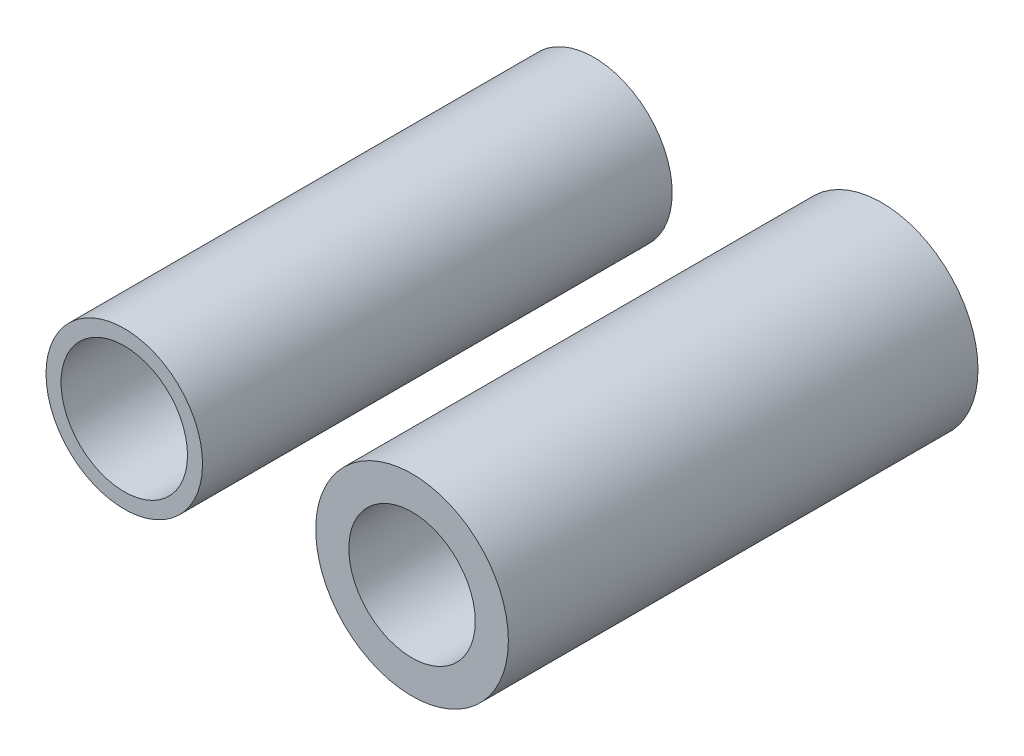
ISO-10303-21;
HEADER;
FILE_DESCRIPTION(('STEP AP214'),'2;1');
FILE_NAME('part.step','',(''),(''),'','','');
FILE_SCHEMA(('AUTOMOTIVE_DESIGN { 1 0 10303 214 1 1 1 1 }'));
ENDSEC;
DATA;
#1=APPLICATION_CONTEXT('core data for automotive mechanical design processes');
#2=APPLICATION_PROTOCOL_DEFINITION('international standard','automotive_design',2000,#1);
#3=PRODUCT_CONTEXT('',#1,'mechanical');
#4=PRODUCT('Part','Part','',(#3));
#5=PRODUCT_RELATED_PRODUCT_CATEGORY('part','',(#4));
#6=PRODUCT_DEFINITION_FORMATION('','',#4);
#7=PRODUCT_DEFINITION_CONTEXT('part definition',#1,'design');
#8=PRODUCT_DEFINITION('design','',#6,#7);
#9=PRODUCT_DEFINITION_SHAPE('','',#8);
#10=(LENGTH_UNIT() NAMED_UNIT(*) SI_UNIT(.MILLI.,.METRE.));
#11=(NAMED_UNIT(*) PLANE_ANGLE_UNIT() SI_UNIT($,.RADIAN.));
#12=(NAMED_UNIT(*) SI_UNIT($,.STERADIAN.) SOLID_ANGLE_UNIT());
#13=UNCERTAINTY_MEASURE_WITH_UNIT(LENGTH_MEASURE(1.E-05),#10,'distance_accuracy_value','');
#14=(GEOMETRIC_REPRESENTATION_CONTEXT(3) GLOBAL_UNCERTAINTY_ASSIGNED_CONTEXT((#13)) GLOBAL_UNIT_ASSIGNED_CONTEXT((#10,
#11,#12)) REPRESENTATION_CONTEXT('',''));
#15=CARTESIAN_POINT('',(0.,0.,0.));
#16=DIRECTION('',(0.,0.,1.));
#17=DIRECTION('',(1.,0.,0.));
#18=AXIS2_PLACEMENT_3D('',#15,#16,#17);
#19=CARTESIAN_POINT('',(-12.1395512540963,0.,19.812));
#20=DIRECTION('',(0.,0.,-1.));
#21=DIRECTION('',(-1.,0.,0.));
#22=AXIS2_PLACEMENT_3D('',#19,#20,#21);
#23=CYLINDRICAL_SURFACE('',#22,3.302);
#24=CARTESIAN_POINT('',(-12.1395512540963,0.,19.812));
#25=DIRECTION('',(0.,0.,-1.));
#26=DIRECTION('',(-1.,0.,0.));
#27=AXIS2_PLACEMENT_3D('',#24,#25,#26);
#28=CIRCLE('',#27,3.302);
#29=CARTESIAN_POINT('',(-15.4415512540963,0.,19.812));
#30=VERTEX_POINT('',#29);
#31=EDGE_CURVE('E11',#30,#30,#28,.T.);
#32=ORIENTED_EDGE('',*,*,#31,.T.);
#33=EDGE_LOOP('',(#32));
#34=FACE_BOUND('',#33,.T.);
#35=CARTESIAN_POINT('',(-12.1395512540963,0.,0.));
#36=DIRECTION('',(0.,0.,-1.));
#37=DIRECTION('',(-1.,0.,0.));
#38=AXIS2_PLACEMENT_3D('',#35,#36,#37);
#39=CIRCLE('',#38,3.302);
#40=CARTESIAN_POINT('',(-15.4415512540963,0.,0.));
#41=VERTEX_POINT('',#40);
#42=EDGE_CURVE('E42',#41,#41,#39,.T.);
#43=ORIENTED_EDGE('',*,*,#42,.F.);
#44=EDGE_LOOP('',(#43));
#45=FACE_BOUND('',#44,.T.);
#46=ADVANCED_FACE('F39',(#34,#45),#23,.T.);
#47=CARTESIAN_POINT('',(-12.1395512540963,0.,19.812));
#48=DIRECTION('',(0.,0.,-1.));
#49=DIRECTION('',(-1.,0.,0.));
#50=AXIS2_PLACEMENT_3D('',#47,#48,#49);
#51=PLANE('',#50);
#52=CARTESIAN_POINT('',(-12.1395512540963,0.,19.812));
#53=DIRECTION('',(0.,0.,1.));
#54=DIRECTION('',(1.,0.,0.));
#55=AXIS2_PLACEMENT_3D('',#52,#53,#54);
#56=CIRCLE('',#55,2.667);
#57=CARTESIAN_POINT('',(-9.47255125409633,0.,19.812));
#58=VERTEX_POINT('',#57);
#59=EDGE_CURVE('E51',#58,#58,#56,.T.);
#60=ORIENTED_EDGE('',*,*,#59,.F.);
#61=EDGE_LOOP('',(#60));
#62=FACE_BOUND('',#61,.T.);
#63=ORIENTED_EDGE('',*,*,#31,.F.);
#64=EDGE_LOOP('',(#63));
#65=FACE_BOUND('',#64,.T.);
#66=ADVANCED_FACE('F66',(#62,#65),#51,.F.);
#67=CARTESIAN_POINT('',(-12.1395512540963,0.,0.));
#68=DIRECTION('',(0.,0.,-1.));
#69=DIRECTION('',(-1.,0.,0.));
#70=AXIS2_PLACEMENT_3D('',#67,#68,#69);
#71=PLANE('',#70);
#72=CARTESIAN_POINT('',(-12.1395512540963,0.,0.));
#73=DIRECTION('',(0.,0.,1.));
#74=DIRECTION('',(1.,0.,0.));
#75=AXIS2_PLACEMENT_3D('',#72,#73,#74);
#76=CIRCLE('',#75,2.667);
#77=CARTESIAN_POINT('',(-9.47255125409633,0.,0.));
#78=VERTEX_POINT('',#77);
#79=EDGE_CURVE('E49',#78,#78,#76,.T.);
#80=ORIENTED_EDGE('',*,*,#79,.T.);
#81=EDGE_LOOP('',(#80));
#82=FACE_BOUND('',#81,.T.);
#83=ORIENTED_EDGE('',*,*,#42,.T.);
#84=EDGE_LOOP('',(#83));
#85=FACE_BOUND('',#84,.T.);
#86=ADVANCED_FACE('F57',(#82,#85),#71,.T.);
#87=CARTESIAN_POINT('',(-12.1395512540963,0.,0.));
#88=DIRECTION('',(0.,0.,1.));
#89=DIRECTION('',(1.,0.,0.));
#90=AXIS2_PLACEMENT_3D('',#87,#88,#89);
#91=CYLINDRICAL_SURFACE('',#90,2.667);
#92=ORIENTED_EDGE('',*,*,#79,.F.);
#93=EDGE_LOOP('',(#92));
#94=FACE_BOUND('',#93,.T.);
#95=ORIENTED_EDGE('',*,*,#59,.T.);
#96=EDGE_LOOP('',(#95));
#97=FACE_BOUND('',#96,.T.);
#98=ADVANCED_FACE('F60',(#94,#97),#91,.F.);
#99=CLOSED_SHELL('',(#46,#66,#86,#98));
#100=MANIFOLD_SOLID_BREP('B2',#99);
#101=CARTESIAN_POINT('',(0.,0.,19.812));
#102=DIRECTION('',(0.,0.,-1.));
#103=DIRECTION('',(-1.,0.,0.));
#104=AXIS2_PLACEMENT_3D('',#101,#102,#103);
#105=CYLINDRICAL_SURFACE('',#104,4.064);
#106=CARTESIAN_POINT('',(0.,0.,19.812));
#107=DIRECTION('',(0.,0.,1.));
#108=DIRECTION('',(1.,0.,0.));
#109=AXIS2_PLACEMENT_3D('',#106,#107,#108);
#110=CIRCLE('',#109,4.064);
#111=CARTESIAN_POINT('',(4.064,0.,19.812));
#112=VERTEX_POINT('',#111);
#113=EDGE_CURVE('E38',#112,#112,#110,.T.);
#114=ORIENTED_EDGE('',*,*,#113,.F.);
#115=EDGE_LOOP('',(#114));
#116=FACE_BOUND('',#115,.T.);
#117=CARTESIAN_POINT('',(0.,0.,0.));
#118=DIRECTION('',(0.,0.,1.));
#119=DIRECTION('',(1.,0.,0.));
#120=AXIS2_PLACEMENT_3D('',#117,#118,#119);
#121=CIRCLE('',#120,4.064);
#122=CARTESIAN_POINT('',(4.064,0.,0.));
#123=VERTEX_POINT('',#122);
#124=EDGE_CURVE('E104',#123,#123,#121,.T.);
#125=ORIENTED_EDGE('',*,*,#124,.T.);
#126=EDGE_LOOP('',(#125));
#127=FACE_BOUND('',#126,.T.);
#128=ADVANCED_FACE('F101',(#116,#127),#105,.T.);
#129=CARTESIAN_POINT('',(0.,0.,19.812));
#130=DIRECTION('',(0.,0.,1.));
#131=DIRECTION('',(1.,0.,0.));
#132=AXIS2_PLACEMENT_3D('',#129,#130,#131);
#133=PLANE('',#132);
#134=CARTESIAN_POINT('',(0.,0.,19.812));
#135=DIRECTION('',(0.,0.,1.));
#136=DIRECTION('',(1.,0.,0.));
#137=AXIS2_PLACEMENT_3D('',#134,#135,#136);
#138=CIRCLE('',#137,2.667);
#139=CARTESIAN_POINT('',(2.667,0.,19.812));
#140=VERTEX_POINT('',#139);
#141=EDGE_CURVE('E113',#140,#140,#138,.T.);
#142=ORIENTED_EDGE('',*,*,#141,.F.);
#143=EDGE_LOOP('',(#142));
#144=FACE_BOUND('',#143,.T.);
#145=ORIENTED_EDGE('',*,*,#113,.T.);
#146=EDGE_LOOP('',(#145));
#147=FACE_BOUND('',#146,.T.);
#148=ADVANCED_FACE('F128',(#144,#147),#133,.T.);
#149=CARTESIAN_POINT('',(0.,0.,0.));
#150=DIRECTION('',(0.,0.,1.));
#151=DIRECTION('',(1.,0.,0.));
#152=AXIS2_PLACEMENT_3D('',#149,#150,#151);
#153=PLANE('',#152);
#154=CARTESIAN_POINT('',(0.,0.,0.));
#155=DIRECTION('',(0.,0.,1.));
#156=DIRECTION('',(1.,0.,0.));
#157=AXIS2_PLACEMENT_3D('',#154,#155,#156);
#158=CIRCLE('',#157,2.667);
#159=CARTESIAN_POINT('',(2.667,0.,0.));
#160=VERTEX_POINT('',#159);
#161=EDGE_CURVE('E111',#160,#160,#158,.T.);
#162=ORIENTED_EDGE('',*,*,#161,.T.);
#163=EDGE_LOOP('',(#162));
#164=FACE_BOUND('',#163,.T.);
#165=ORIENTED_EDGE('',*,*,#124,.F.);
#166=EDGE_LOOP('',(#165));
#167=FACE_BOUND('',#166,.T.);
#168=ADVANCED_FACE('F119',(#164,#167),#153,.F.);
#169=CARTESIAN_POINT('',(0.,0.,0.));
#170=DIRECTION('',(0.,0.,1.));
#171=DIRECTION('',(1.,0.,0.));
#172=AXIS2_PLACEMENT_3D('',#169,#170,#171);
#173=CYLINDRICAL_SURFACE('',#172,2.667);
#174=ORIENTED_EDGE('',*,*,#161,.F.);
#175=EDGE_LOOP('',(#174));
#176=FACE_BOUND('',#175,.T.);
#177=ORIENTED_EDGE('',*,*,#141,.T.);
#178=EDGE_LOOP('',(#177));
#179=FACE_BOUND('',#178,.T.);
#180=ADVANCED_FACE('F122',(#176,#179),#173,.F.);
#181=CLOSED_SHELL('',(#128,#148,#168,#180));
#182=MANIFOLD_SOLID_BREP('B6',#181);
#183=ADVANCED_BREP_SHAPE_REPRESENTATION('',(#18,#100,#182),#14);
#184=SHAPE_DEFINITION_REPRESENTATION(#9,#183);
ENDSEC;
END-ISO-10303-21;
